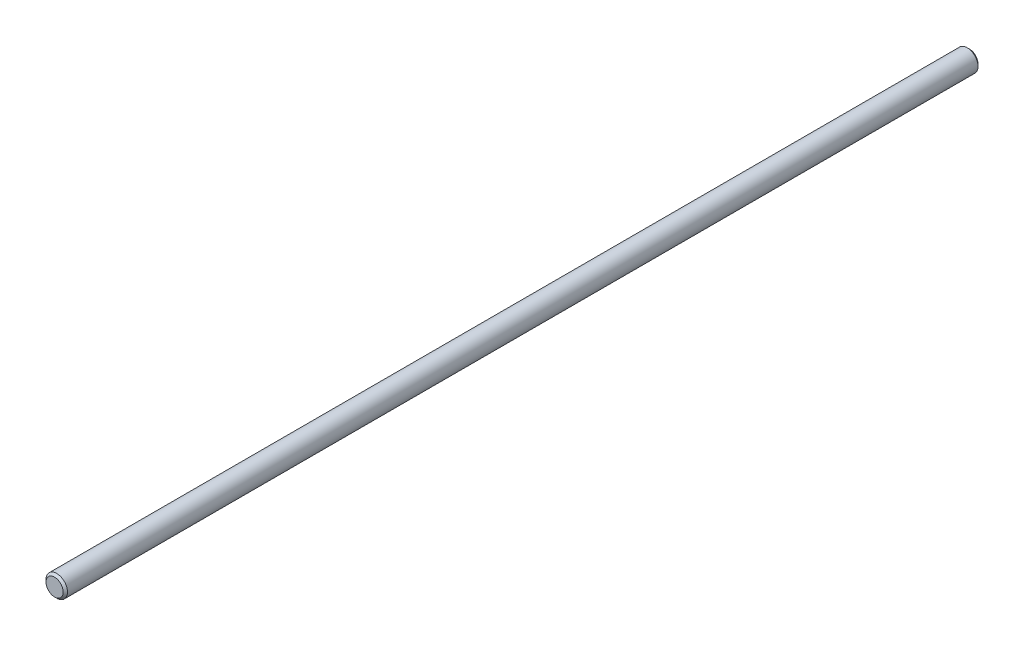
ISO-10303-21;
HEADER;
FILE_DESCRIPTION(('STEP AP214'),'2;1');
FILE_NAME('part.step','',(''),(''),'','','');
FILE_SCHEMA(('AUTOMOTIVE_DESIGN { 1 0 10303 214 1 1 1 1 }'));
ENDSEC;
DATA;
#1=APPLICATION_CONTEXT('core data for automotive mechanical design processes');
#2=APPLICATION_PROTOCOL_DEFINITION('international standard','automotive_design',2000,#1);
#3=PRODUCT_CONTEXT('',#1,'mechanical');
#4=PRODUCT('Part','Part','',(#3));
#5=PRODUCT_RELATED_PRODUCT_CATEGORY('part','',(#4));
#6=PRODUCT_DEFINITION_FORMATION('','',#4);
#7=PRODUCT_DEFINITION_CONTEXT('part definition',#1,'design');
#8=PRODUCT_DEFINITION('design','',#6,#7);
#9=PRODUCT_DEFINITION_SHAPE('','',#8);
#10=(LENGTH_UNIT() NAMED_UNIT(*) SI_UNIT(.MILLI.,.METRE.));
#11=(NAMED_UNIT(*) PLANE_ANGLE_UNIT() SI_UNIT($,.RADIAN.));
#12=(NAMED_UNIT(*) SI_UNIT($,.STERADIAN.) SOLID_ANGLE_UNIT());
#13=UNCERTAINTY_MEASURE_WITH_UNIT(LENGTH_MEASURE(1.E-05),#10,'distance_accuracy_value','');
#14=(GEOMETRIC_REPRESENTATION_CONTEXT(3) GLOBAL_UNCERTAINTY_ASSIGNED_CONTEXT((#13)) GLOBAL_UNIT_ASSIGNED_CONTEXT((#10,
#11,#12)) REPRESENTATION_CONTEXT('',''));
#15=CARTESIAN_POINT('',(0.,0.,0.));
#16=DIRECTION('',(0.,0.,1.));
#17=DIRECTION('',(1.,0.,0.));
#18=AXIS2_PLACEMENT_3D('',#15,#16,#17);
#19=CARTESIAN_POINT('',(0.,0.,213.106));
#20=DIRECTION('',(0.,0.,-1.));
#21=DIRECTION('',(-1.,0.,0.));
#22=AXIS2_PLACEMENT_3D('',#19,#20,#21);
#23=CYLINDRICAL_SURFACE('',#22,5.);
#24=CARTESIAN_POINT('',(0.,0.,-212.106));
#25=DIRECTION('',(0.,0.,1.));
#26=DIRECTION('',(1.,0.,0.));
#27=AXIS2_PLACEMENT_3D('',#24,#25,#26);
#28=CIRCLE('',#27,5.);
#29=CARTESIAN_POINT('',(5.,0.,-212.106));
#30=VERTEX_POINT('',#29);
#31=EDGE_CURVE('E52',#30,#30,#28,.T.);
#32=ORIENTED_EDGE('',*,*,#31,.T.);
#33=EDGE_LOOP('',(#32));
#34=FACE_BOUND('',#33,.T.);
#35=CARTESIAN_POINT('',(0.,0.,212.106));
#36=DIRECTION('',(0.,0.,1.));
#37=DIRECTION('',(1.,0.,0.));
#38=AXIS2_PLACEMENT_3D('',#35,#36,#37);
#39=CIRCLE('',#38,5.);
#40=CARTESIAN_POINT('',(5.,0.,212.106));
#41=VERTEX_POINT('',#40);
#42=EDGE_CURVE('E57',#41,#41,#39,.F.);
#43=ORIENTED_EDGE('',*,*,#42,.T.);
#44=EDGE_LOOP('',(#43));
#45=FACE_BOUND('',#44,.T.);
#46=ADVANCED_FACE('F39',(#34,#45),#23,.T.);
#47=CARTESIAN_POINT('',(0.,0.,213.106));
#48=DIRECTION('',(0.,0.,1.));
#49=DIRECTION('',(1.,0.,0.));
#50=AXIS2_PLACEMENT_3D('',#47,#48,#49);
#51=PLANE('',#50);
#52=CARTESIAN_POINT('',(0.,0.,213.106));
#53=DIRECTION('',(0.,0.,1.));
#54=DIRECTION('',(1.,0.,0.));
#55=AXIS2_PLACEMENT_3D('',#52,#53,#54);
#56=CIRCLE('',#55,4.00000000000011);
#57=CARTESIAN_POINT('',(4.00000000000011,0.,213.106));
#58=VERTEX_POINT('',#57);
#59=EDGE_CURVE('E10',#58,#58,#56,.T.);
#60=ORIENTED_EDGE('',*,*,#59,.T.);
#61=EDGE_LOOP('',(#60));
#62=FACE_BOUND('',#61,.T.);
#63=ADVANCED_FACE('F74',(#62),#51,.T.);
#64=CARTESIAN_POINT('',(0.,0.,-213.106));
#65=DIRECTION('',(0.,0.,1.));
#66=DIRECTION('',(1.,0.,0.));
#67=AXIS2_PLACEMENT_3D('',#64,#65,#66);
#68=PLANE('',#67);
#69=CARTESIAN_POINT('',(0.,0.,-213.106));
#70=DIRECTION('',(0.,0.,1.));
#71=DIRECTION('',(1.,0.,0.));
#72=AXIS2_PLACEMENT_3D('',#69,#70,#71);
#73=CIRCLE('',#72,3.99999999999995);
#74=CARTESIAN_POINT('',(3.99999999999995,0.,-213.106));
#75=VERTEX_POINT('',#74);
#76=EDGE_CURVE('E47',#75,#75,#73,.F.);
#77=ORIENTED_EDGE('',*,*,#76,.T.);
#78=EDGE_LOOP('',(#77));
#79=FACE_BOUND('',#78,.T.);
#80=ADVANCED_FACE('F71',(#79),#68,.F.);
#81=CARTESIAN_POINT('',(0.,0.,-212.106));
#82=DIRECTION('',(0.,0.,1.));
#83=DIRECTION('',(1.,0.,0.));
#84=AXIS2_PLACEMENT_3D('',#81,#82,#83);
#85=CONICAL_SURFACE('',#84,5.,0.785398163397474);
#86=ORIENTED_EDGE('',*,*,#76,.F.);
#87=EDGE_LOOP('',(#86));
#88=FACE_BOUND('',#87,.T.);
#89=ORIENTED_EDGE('',*,*,#31,.F.);
#90=EDGE_LOOP('',(#89));
#91=FACE_BOUND('',#90,.T.);
#92=ADVANCED_FACE('F67',(#88,#91),#85,.T.);
#93=CARTESIAN_POINT('',(0.,0.,213.106));
#94=DIRECTION('',(0.,0.,-1.));
#95=DIRECTION('',(-1.,0.,0.));
#96=AXIS2_PLACEMENT_3D('',#93,#94,#95);
#97=CONICAL_SURFACE('',#96,4.00000000000011,0.785398163397446);
#98=ORIENTED_EDGE('',*,*,#42,.F.);
#99=EDGE_LOOP('',(#98));
#100=FACE_BOUND('',#99,.T.);
#101=ORIENTED_EDGE('',*,*,#59,.F.);
#102=EDGE_LOOP('',(#101));
#103=FACE_BOUND('',#102,.T.);
#104=ADVANCED_FACE('F41',(#100,#103),#97,.T.);
#105=CLOSED_SHELL('',(#46,#63,#80,#92,#104));
#106=MANIFOLD_SOLID_BREP('B2',#105);
#107=ADVANCED_BREP_SHAPE_REPRESENTATION('',(#18,#106),#14);
#108=SHAPE_DEFINITION_REPRESENTATION(#9,#107);
ENDSEC;
END-ISO-10303-21;
